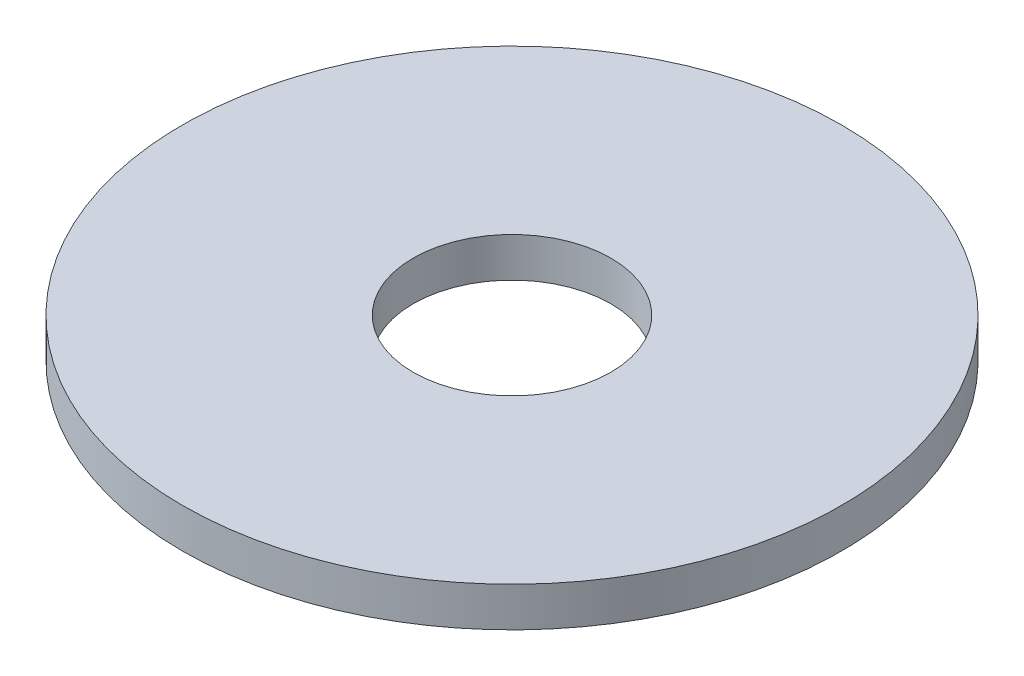
ISO-10303-21;
HEADER;
FILE_DESCRIPTION(('STEP AP214'),'2;1');
FILE_NAME('part.step','',(''),(''),'','','');
FILE_SCHEMA(('AUTOMOTIVE_DESIGN { 1 0 10303 214 1 1 1 1 }'));
ENDSEC;
DATA;
#1=APPLICATION_CONTEXT('core data for automotive mechanical design processes');
#2=APPLICATION_PROTOCOL_DEFINITION('international standard','automotive_design',2000,#1);
#3=PRODUCT_CONTEXT('',#1,'mechanical');
#4=PRODUCT('Part','Part','',(#3));
#5=PRODUCT_RELATED_PRODUCT_CATEGORY('part','',(#4));
#6=PRODUCT_DEFINITION_FORMATION('','',#4);
#7=PRODUCT_DEFINITION_CONTEXT('part definition',#1,'design');
#8=PRODUCT_DEFINITION('design','',#6,#7);
#9=PRODUCT_DEFINITION_SHAPE('','',#8);
#10=(LENGTH_UNIT() NAMED_UNIT(*) SI_UNIT(.MILLI.,.METRE.));
#11=(NAMED_UNIT(*) PLANE_ANGLE_UNIT() SI_UNIT($,.RADIAN.));
#12=(NAMED_UNIT(*) SI_UNIT($,.STERADIAN.) SOLID_ANGLE_UNIT());
#13=UNCERTAINTY_MEASURE_WITH_UNIT(LENGTH_MEASURE(1.E-05),#10,'distance_accuracy_value','');
#14=(GEOMETRIC_REPRESENTATION_CONTEXT(3) GLOBAL_UNCERTAINTY_ASSIGNED_CONTEXT((#13)) GLOBAL_UNIT_ASSIGNED_CONTEXT((#10,
#11,#12)) REPRESENTATION_CONTEXT('',''));
#15=CARTESIAN_POINT('',(0.,0.,0.));
#16=DIRECTION('',(0.,0.,1.));
#17=DIRECTION('',(1.,0.,0.));
#18=AXIS2_PLACEMENT_3D('',#15,#16,#17);
#19=CARTESIAN_POINT('',(0.,9.,0.));
#20=DIRECTION('',(0.,-1.,0.));
#21=DIRECTION('',(0.,0.,-1.));
#22=AXIS2_PLACEMENT_3D('',#19,#20,#21);
#23=CYLINDRICAL_SURFACE('',#22,75.);
#24=CARTESIAN_POINT('',(0.,9.,0.));
#25=DIRECTION('',(0.,1.,0.));
#26=DIRECTION('',(0.,0.,1.));
#27=AXIS2_PLACEMENT_3D('',#24,#25,#26);
#28=CIRCLE('',#27,75.);
#29=CARTESIAN_POINT('',(0.,9.,75.));
#30=VERTEX_POINT('',#29);
#31=EDGE_CURVE('E10',#30,#30,#28,.T.);
#32=ORIENTED_EDGE('',*,*,#31,.F.);
#33=EDGE_LOOP('',(#32));
#34=FACE_BOUND('',#33,.T.);
#35=CARTESIAN_POINT('',(0.,0.,0.));
#36=DIRECTION('',(0.,1.,0.));
#37=DIRECTION('',(0.,0.,1.));
#38=AXIS2_PLACEMENT_3D('',#35,#36,#37);
#39=CIRCLE('',#38,75.);
#40=CARTESIAN_POINT('',(0.,0.,75.));
#41=VERTEX_POINT('',#40);
#42=EDGE_CURVE('E37',#41,#41,#39,.T.);
#43=ORIENTED_EDGE('',*,*,#42,.T.);
#44=EDGE_LOOP('',(#43));
#45=FACE_BOUND('',#44,.T.);
#46=ADVANCED_FACE('F40',(#34,#45),#23,.T.);
#47=CARTESIAN_POINT('',(0.,9.,0.));
#48=DIRECTION('',(0.,1.,0.));
#49=DIRECTION('',(0.,0.,1.));
#50=AXIS2_PLACEMENT_3D('',#47,#48,#49);
#51=PLANE('',#50);
#52=CARTESIAN_POINT('',(0.,9.,0.));
#53=DIRECTION('',(0.,1.,0.));
#54=DIRECTION('',(0.,0.,1.));
#55=AXIS2_PLACEMENT_3D('',#52,#53,#54);
#56=CIRCLE('',#55,22.5);
#57=CARTESIAN_POINT('',(0.,9.,22.5));
#58=VERTEX_POINT('',#57);
#59=EDGE_CURVE('E50',#58,#58,#56,.T.);
#60=ORIENTED_EDGE('',*,*,#59,.F.);
#61=EDGE_LOOP('',(#60));
#62=FACE_BOUND('',#61,.T.);
#63=ORIENTED_EDGE('',*,*,#31,.T.);
#64=EDGE_LOOP('',(#63));
#65=FACE_BOUND('',#64,.T.);
#66=ADVANCED_FACE('F59',(#62,#65),#51,.T.);
#67=CARTESIAN_POINT('',(0.,0.,0.));
#68=DIRECTION('',(0.,1.,0.));
#69=DIRECTION('',(0.,0.,1.));
#70=AXIS2_PLACEMENT_3D('',#67,#68,#69);
#71=PLANE('',#70);
#72=CARTESIAN_POINT('',(0.,0.,0.));
#73=DIRECTION('',(0.,1.,0.));
#74=DIRECTION('',(0.,0.,1.));
#75=AXIS2_PLACEMENT_3D('',#72,#73,#74);
#76=CIRCLE('',#75,22.5);
#77=CARTESIAN_POINT('',(0.,0.,22.5));
#78=VERTEX_POINT('',#77);
#79=EDGE_CURVE('E47',#78,#78,#76,.T.);
#80=ORIENTED_EDGE('',*,*,#79,.T.);
#81=EDGE_LOOP('',(#80));
#82=FACE_BOUND('',#81,.T.);
#83=ORIENTED_EDGE('',*,*,#42,.F.);
#84=EDGE_LOOP('',(#83));
#85=FACE_BOUND('',#84,.T.);
#86=ADVANCED_FACE('F58',(#82,#85),#71,.F.);
#87=CARTESIAN_POINT('',(0.,9.,0.));
#88=DIRECTION('',(0.,-1.,0.));
#89=DIRECTION('',(0.,0.,-1.));
#90=AXIS2_PLACEMENT_3D('',#87,#88,#89);
#91=CYLINDRICAL_SURFACE('',#90,22.5);
#92=ORIENTED_EDGE('',*,*,#59,.T.);
#93=EDGE_LOOP('',(#92));
#94=FACE_BOUND('',#93,.T.);
#95=ORIENTED_EDGE('',*,*,#79,.F.);
#96=EDGE_LOOP('',(#95));
#97=FACE_BOUND('',#96,.T.);
#98=ADVANCED_FACE('F54',(#94,#97),#91,.F.);
#99=CLOSED_SHELL('',(#46,#66,#86,#98));
#100=MANIFOLD_SOLID_BREP('B2',#99);
#101=ADVANCED_BREP_SHAPE_REPRESENTATION('',(#18,#100),#14);
#102=SHAPE_DEFINITION_REPRESENTATION(#9,#101);
ENDSEC;
END-ISO-10303-21;
